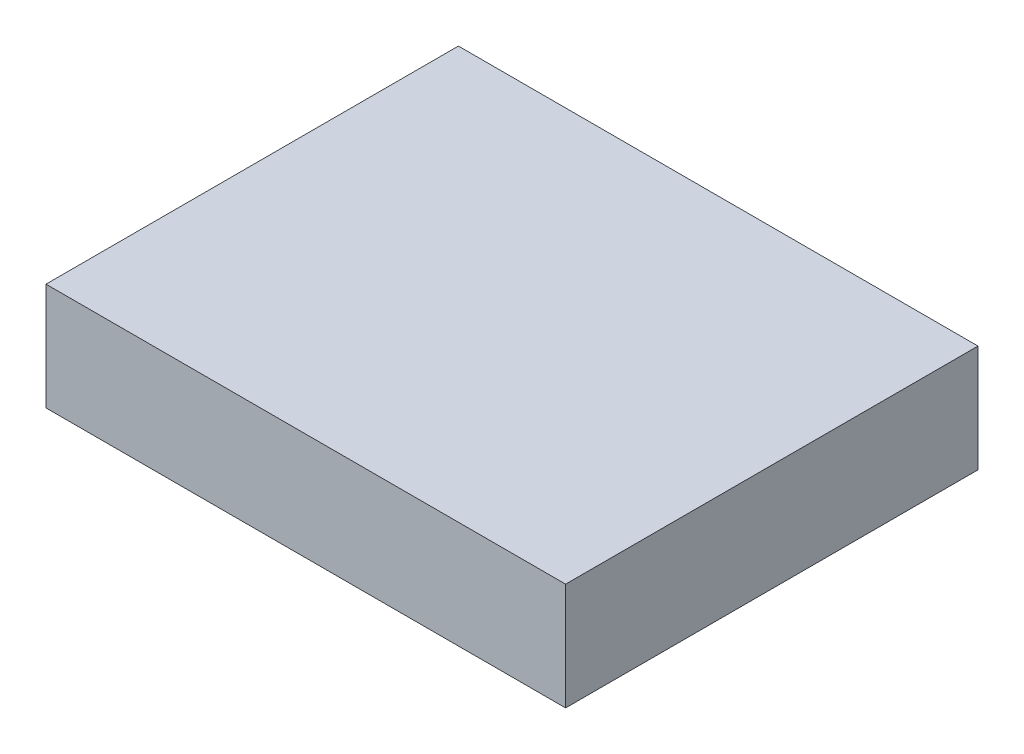
ISO-10303-21;
HEADER;
FILE_DESCRIPTION(('STEP AP214'),'2;1');
FILE_NAME('part.step','',(''),(''),'','','');
FILE_SCHEMA(('AUTOMOTIVE_DESIGN { 1 0 10303 214 1 1 1 1 }'));
ENDSEC;
DATA;
#1=APPLICATION_CONTEXT('core data for automotive mechanical design processes');
#2=APPLICATION_PROTOCOL_DEFINITION('international standard','automotive_design',2000,#1);
#3=PRODUCT_CONTEXT('',#1,'mechanical');
#4=PRODUCT('Part','Part','',(#3));
#5=PRODUCT_RELATED_PRODUCT_CATEGORY('part','',(#4));
#6=PRODUCT_DEFINITION_FORMATION('','',#4);
#7=PRODUCT_DEFINITION_CONTEXT('part definition',#1,'design');
#8=PRODUCT_DEFINITION('design','',#6,#7);
#9=PRODUCT_DEFINITION_SHAPE('','',#8);
#10=(LENGTH_UNIT() NAMED_UNIT(*) SI_UNIT(.MILLI.,.METRE.));
#11=(NAMED_UNIT(*) PLANE_ANGLE_UNIT() SI_UNIT($,.RADIAN.));
#12=(NAMED_UNIT(*) SI_UNIT($,.STERADIAN.) SOLID_ANGLE_UNIT());
#13=UNCERTAINTY_MEASURE_WITH_UNIT(LENGTH_MEASURE(1.E-05),#10,'distance_accuracy_value','');
#14=(GEOMETRIC_REPRESENTATION_CONTEXT(3) GLOBAL_UNCERTAINTY_ASSIGNED_CONTEXT((#13)) GLOBAL_UNIT_ASSIGNED_CONTEXT((#10,
#11,#12)) REPRESENTATION_CONTEXT('',''));
#15=CARTESIAN_POINT('',(0.,0.,0.));
#16=DIRECTION('',(0.,0.,1.));
#17=DIRECTION('',(1.,0.,0.));
#18=AXIS2_PLACEMENT_3D('',#15,#16,#17);
#19=CARTESIAN_POINT('',(-80.01,33.02,-63.5));
#20=DIRECTION('',(0.,0.,-1.));
#21=DIRECTION('',(-1.,0.,0.));
#22=AXIS2_PLACEMENT_3D('',#19,#20,#21);
#23=PLANE('',#22);
#24=DIRECTION('',(1.,0.,0.));
#25=VECTOR('',#24,1.);
#26=CARTESIAN_POINT('',(-80.01,0.,-63.5));
#27=LINE('',#26,#25);
#28=CARTESIAN_POINT('',(-80.01,0.,-63.5));
#29=VERTEX_POINT('',#28);
#30=CARTESIAN_POINT('',(80.01,0.,-63.5));
#31=VERTEX_POINT('',#30);
#32=EDGE_CURVE('E98',#29,#31,#27,.T.);
#33=ORIENTED_EDGE('',*,*,#32,.F.);
#34=DIRECTION('',(0.,-1.,0.));
#35=VECTOR('',#34,1.);
#36=CARTESIAN_POINT('',(-80.01,33.02,-63.5));
#37=LINE('',#36,#35);
#38=CARTESIAN_POINT('',(-80.01,33.02,-63.5));
#39=VERTEX_POINT('',#38);
#40=EDGE_CURVE('E11',#39,#29,#37,.T.);
#41=ORIENTED_EDGE('',*,*,#40,.F.);
#42=DIRECTION('',(1.,0.,0.));
#43=VECTOR('',#42,1.);
#44=CARTESIAN_POINT('',(-80.01,33.02,-63.5));
#45=LINE('',#44,#43);
#46=CARTESIAN_POINT('',(80.01,33.02,-63.5));
#47=VERTEX_POINT('',#46);
#48=EDGE_CURVE('E93',#39,#47,#45,.T.);
#49=ORIENTED_EDGE('',*,*,#48,.T.);
#50=DIRECTION('',(0.,-1.,0.));
#51=VECTOR('',#50,1.);
#52=CARTESIAN_POINT('',(80.01,33.02,-63.5));
#53=LINE('',#52,#51);
#54=EDGE_CURVE('E36',#47,#31,#53,.T.);
#55=ORIENTED_EDGE('',*,*,#54,.T.);
#56=EDGE_LOOP('',(#33,#41,#49,#55));
#57=FACE_BOUND('',#56,.T.);
#58=ADVANCED_FACE('F33',(#57),#23,.T.);
#59=CARTESIAN_POINT('',(-80.01,33.02,-63.5));
#60=DIRECTION('',(1.,0.,0.));
#61=DIRECTION('',(0.,0.,-1.));
#62=AXIS2_PLACEMENT_3D('',#59,#60,#61);
#63=PLANE('',#62);
#64=DIRECTION('',(0.,0.,1.));
#65=VECTOR('',#64,1.);
#66=CARTESIAN_POINT('',(-80.01,0.,-63.5));
#67=LINE('',#66,#65);
#68=CARTESIAN_POINT('',(-80.01,0.,63.5));
#69=VERTEX_POINT('',#68);
#70=EDGE_CURVE('E66',#29,#69,#67,.T.);
#71=ORIENTED_EDGE('',*,*,#70,.T.);
#72=DIRECTION('',(0.,-1.,0.));
#73=VECTOR('',#72,1.);
#74=CARTESIAN_POINT('',(-80.01,33.02,63.5));
#75=LINE('',#74,#73);
#76=CARTESIAN_POINT('',(-80.01,33.02,63.5));
#77=VERTEX_POINT('',#76);
#78=EDGE_CURVE('E42',#77,#69,#75,.T.);
#79=ORIENTED_EDGE('',*,*,#78,.F.);
#80=DIRECTION('',(0.,0.,1.));
#81=VECTOR('',#80,1.);
#82=CARTESIAN_POINT('',(-80.01,33.02,-63.5));
#83=LINE('',#82,#81);
#84=EDGE_CURVE('E83',#39,#77,#83,.T.);
#85=ORIENTED_EDGE('',*,*,#84,.F.);
#86=ORIENTED_EDGE('',*,*,#40,.T.);
#87=EDGE_LOOP('',(#71,#79,#85,#86));
#88=FACE_BOUND('',#87,.T.);
#89=ADVANCED_FACE('F108',(#88),#63,.F.);
#90=CARTESIAN_POINT('',(-80.01,33.02,63.5));
#91=DIRECTION('',(0.,0.,-1.));
#92=DIRECTION('',(-1.,0.,0.));
#93=AXIS2_PLACEMENT_3D('',#90,#91,#92);
#94=PLANE('',#93);
#95=DIRECTION('',(1.,0.,0.));
#96=VECTOR('',#95,1.);
#97=CARTESIAN_POINT('',(-80.01,0.,63.5));
#98=LINE('',#97,#96);
#99=CARTESIAN_POINT('',(80.01,0.,63.5));
#100=VERTEX_POINT('',#99);
#101=EDGE_CURVE('E90',#69,#100,#98,.T.);
#102=ORIENTED_EDGE('',*,*,#101,.T.);
#103=DIRECTION('',(0.,-1.,0.));
#104=VECTOR('',#103,1.);
#105=CARTESIAN_POINT('',(80.01,33.02,63.5));
#106=LINE('',#105,#104);
#107=CARTESIAN_POINT('',(80.01,33.02,63.5));
#108=VERTEX_POINT('',#107);
#109=EDGE_CURVE('E87',#108,#100,#106,.T.);
#110=ORIENTED_EDGE('',*,*,#109,.F.);
#111=DIRECTION('',(1.,0.,0.));
#112=VECTOR('',#111,1.);
#113=CARTESIAN_POINT('',(-80.01,33.02,63.5));
#114=LINE('',#113,#112);
#115=EDGE_CURVE('E78',#77,#108,#114,.T.);
#116=ORIENTED_EDGE('',*,*,#115,.F.);
#117=ORIENTED_EDGE('',*,*,#78,.T.);
#118=EDGE_LOOP('',(#102,#110,#116,#117));
#119=FACE_BOUND('',#118,.T.);
#120=ADVANCED_FACE('F88',(#119),#94,.F.);
#121=CARTESIAN_POINT('',(80.01,33.02,-63.5));
#122=DIRECTION('',(1.,0.,0.));
#123=DIRECTION('',(0.,0.,-1.));
#124=AXIS2_PLACEMENT_3D('',#121,#122,#123);
#125=PLANE('',#124);
#126=DIRECTION('',(0.,0.,1.));
#127=VECTOR('',#126,1.);
#128=CARTESIAN_POINT('',(80.01,0.,-63.5));
#129=LINE('',#128,#127);
#130=EDGE_CURVE('E101',#31,#100,#129,.T.);
#131=ORIENTED_EDGE('',*,*,#130,.F.);
#132=ORIENTED_EDGE('',*,*,#54,.F.);
#133=DIRECTION('',(0.,0.,1.));
#134=VECTOR('',#133,1.);
#135=CARTESIAN_POINT('',(80.01,33.02,-63.5));
#136=LINE('',#135,#134);
#137=EDGE_CURVE('E82',#47,#108,#136,.T.);
#138=ORIENTED_EDGE('',*,*,#137,.T.);
#139=ORIENTED_EDGE('',*,*,#109,.T.);
#140=EDGE_LOOP('',(#131,#132,#138,#139));
#141=FACE_BOUND('',#140,.T.);
#142=ADVANCED_FACE('F92',(#141),#125,.T.);
#143=CARTESIAN_POINT('',(0.,33.02,0.));
#144=DIRECTION('',(0.,-1.,0.));
#145=DIRECTION('',(0.,0.,-1.));
#146=AXIS2_PLACEMENT_3D('',#143,#144,#145);
#147=PLANE('',#146);
#148=ORIENTED_EDGE('',*,*,#48,.F.);
#149=ORIENTED_EDGE('',*,*,#84,.T.);
#150=ORIENTED_EDGE('',*,*,#115,.T.);
#151=ORIENTED_EDGE('',*,*,#137,.F.);
#152=EDGE_LOOP('',(#148,#149,#150,#151));
#153=FACE_BOUND('',#152,.T.);
#154=ADVANCED_FACE('F81',(#153),#147,.F.);
#155=CARTESIAN_POINT('',(0.,0.,0.));
#156=DIRECTION('',(0.,-1.,0.));
#157=DIRECTION('',(0.,0.,-1.));
#158=AXIS2_PLACEMENT_3D('',#155,#156,#157);
#159=PLANE('',#158);
#160=ORIENTED_EDGE('',*,*,#32,.T.);
#161=ORIENTED_EDGE('',*,*,#130,.T.);
#162=ORIENTED_EDGE('',*,*,#101,.F.);
#163=ORIENTED_EDGE('',*,*,#70,.F.);
#164=EDGE_LOOP('',(#160,#161,#162,#163));
#165=FACE_BOUND('',#164,.T.);
#166=ADVANCED_FACE('F106',(#165),#159,.T.);
#167=CLOSED_SHELL('',(#58,#89,#120,#142,#154,#166));
#168=MANIFOLD_SOLID_BREP('B2',#167);
#169=ADVANCED_BREP_SHAPE_REPRESENTATION('',(#18,#168),#14);
#170=SHAPE_DEFINITION_REPRESENTATION(#9,#169);
ENDSEC;
END-ISO-10303-21;
